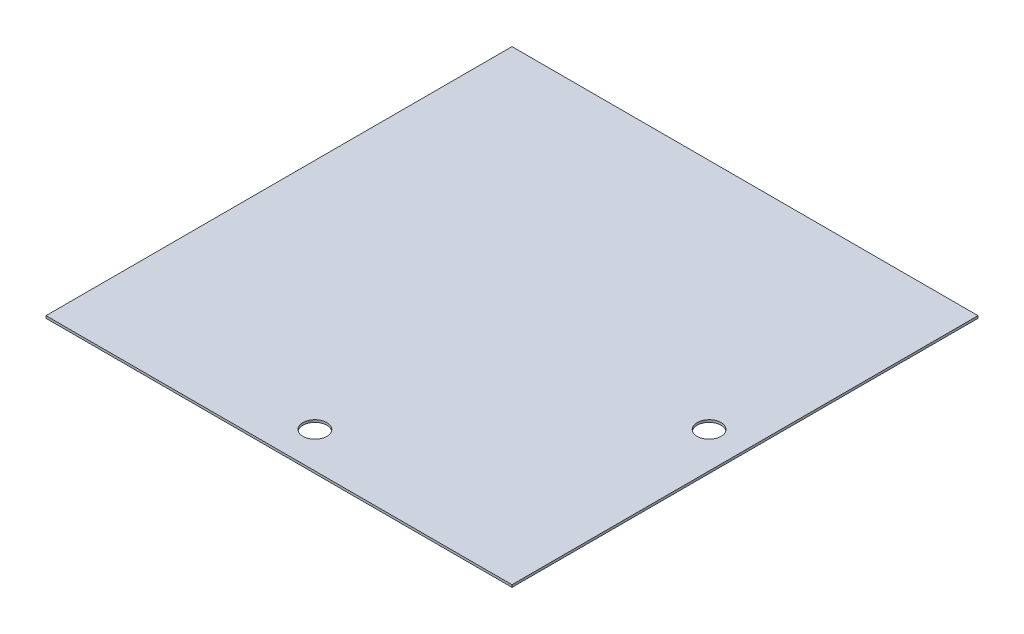
ISO-10303-21;
HEADER;
FILE_DESCRIPTION(('STEP AP214'),'2;1');
FILE_NAME('part.step','',(''),(''),'','','');
FILE_SCHEMA(('AUTOMOTIVE_DESIGN { 1 0 10303 214 1 1 1 1 }'));
ENDSEC;
DATA;
#1=APPLICATION_CONTEXT('core data for automotive mechanical design processes');
#2=APPLICATION_PROTOCOL_DEFINITION('international standard','automotive_design',2000,#1);
#3=PRODUCT_CONTEXT('',#1,'mechanical');
#4=PRODUCT('Part','Part','',(#3));
#5=PRODUCT_RELATED_PRODUCT_CATEGORY('part','',(#4));
#6=PRODUCT_DEFINITION_FORMATION('','',#4);
#7=PRODUCT_DEFINITION_CONTEXT('part definition',#1,'design');
#8=PRODUCT_DEFINITION('design','',#6,#7);
#9=PRODUCT_DEFINITION_SHAPE('','',#8);
#10=(LENGTH_UNIT() NAMED_UNIT(*) SI_UNIT(.MILLI.,.METRE.));
#11=(NAMED_UNIT(*) PLANE_ANGLE_UNIT() SI_UNIT($,.RADIAN.));
#12=(NAMED_UNIT(*) SI_UNIT($,.STERADIAN.) SOLID_ANGLE_UNIT());
#13=UNCERTAINTY_MEASURE_WITH_UNIT(LENGTH_MEASURE(1.E-05),#10,'distance_accuracy_value','');
#14=(GEOMETRIC_REPRESENTATION_CONTEXT(3) GLOBAL_UNCERTAINTY_ASSIGNED_CONTEXT((#13)) GLOBAL_UNIT_ASSIGNED_CONTEXT((#10,
#11,#12)) REPRESENTATION_CONTEXT('',''));
#15=CARTESIAN_POINT('',(0.,0.,0.));
#16=DIRECTION('',(0.,0.,1.));
#17=DIRECTION('',(1.,0.,0.));
#18=AXIS2_PLACEMENT_3D('',#15,#16,#17);
#19=CARTESIAN_POINT('',(247.4214,2.5,247.4214));
#20=DIRECTION('',(-1.,0.,0.));
#21=DIRECTION('',(0.,0.,1.));
#22=AXIS2_PLACEMENT_3D('',#19,#20,#21);
#23=PLANE('',#22);
#24=DIRECTION('',(0.,0.,-1.));
#25=VECTOR('',#24,1.);
#26=CARTESIAN_POINT('',(247.4214,0.,247.4214));
#27=LINE('',#26,#25);
#28=CARTESIAN_POINT('',(247.4214,0.,247.4214));
#29=VERTEX_POINT('',#28);
#30=CARTESIAN_POINT('',(247.4214,0.,-247.4214));
#31=VERTEX_POINT('',#30);
#32=EDGE_CURVE('E106',#29,#31,#27,.T.);
#33=ORIENTED_EDGE('',*,*,#32,.T.);
#34=DIRECTION('',(0.,-1.,0.));
#35=VECTOR('',#34,1.);
#36=CARTESIAN_POINT('',(247.4214,2.5,-247.4214));
#37=LINE('',#36,#35);
#38=CARTESIAN_POINT('',(247.4214,2.5,-247.4214));
#39=VERTEX_POINT('',#38);
#40=EDGE_CURVE('E11',#39,#31,#37,.T.);
#41=ORIENTED_EDGE('',*,*,#40,.F.);
#42=DIRECTION('',(0.,0.,-1.));
#43=VECTOR('',#42,1.);
#44=CARTESIAN_POINT('',(247.4214,2.5,247.4214));
#45=LINE('',#44,#43);
#46=CARTESIAN_POINT('',(247.4214,2.5,247.4214));
#47=VERTEX_POINT('',#46);
#48=EDGE_CURVE('E90',#47,#39,#45,.T.);
#49=ORIENTED_EDGE('',*,*,#48,.F.);
#50=DIRECTION('',(0.,-1.,0.));
#51=VECTOR('',#50,1.);
#52=CARTESIAN_POINT('',(247.4214,2.5,247.4214));
#53=LINE('',#52,#51);
#54=EDGE_CURVE('E102',#47,#29,#53,.T.);
#55=ORIENTED_EDGE('',*,*,#54,.T.);
#56=EDGE_LOOP('',(#33,#41,#49,#55));
#57=FACE_BOUND('',#56,.T.);
#58=ADVANCED_FACE('F38',(#57),#23,.F.);
#59=CARTESIAN_POINT('',(-247.4214,2.5,-247.4214));
#60=DIRECTION('',(0.,0.,1.));
#61=DIRECTION('',(1.,0.,0.));
#62=AXIS2_PLACEMENT_3D('',#59,#60,#61);
#63=PLANE('',#62);
#64=DIRECTION('',(-1.,0.,0.));
#65=VECTOR('',#64,1.);
#66=CARTESIAN_POINT('',(-247.4214,0.,-247.4214));
#67=LINE('',#66,#65);
#68=CARTESIAN_POINT('',(-247.4214,0.,-247.4214));
#69=VERTEX_POINT('',#68);
#70=EDGE_CURVE('E95',#31,#69,#67,.T.);
#71=ORIENTED_EDGE('',*,*,#70,.T.);
#72=DIRECTION('',(0.,-1.,0.));
#73=VECTOR('',#72,1.);
#74=CARTESIAN_POINT('',(-247.4214,2.5,-247.4214));
#75=LINE('',#74,#73);
#76=CARTESIAN_POINT('',(-247.4214,2.5,-247.4214));
#77=VERTEX_POINT('',#76);
#78=EDGE_CURVE('E47',#77,#69,#75,.T.);
#79=ORIENTED_EDGE('',*,*,#78,.F.);
#80=DIRECTION('',(-1.,0.,0.));
#81=VECTOR('',#80,1.);
#82=CARTESIAN_POINT('',(-247.4214,2.5,-247.4214));
#83=LINE('',#82,#81);
#84=EDGE_CURVE('E85',#39,#77,#83,.T.);
#85=ORIENTED_EDGE('',*,*,#84,.F.);
#86=ORIENTED_EDGE('',*,*,#40,.T.);
#87=EDGE_LOOP('',(#71,#79,#85,#86));
#88=FACE_BOUND('',#87,.T.);
#89=ADVANCED_FACE('F94',(#88),#63,.F.);
#90=CARTESIAN_POINT('',(-247.4214,2.5,247.4214));
#91=DIRECTION('',(1.,0.,0.));
#92=DIRECTION('',(0.,0.,-1.));
#93=AXIS2_PLACEMENT_3D('',#90,#91,#92);
#94=PLANE('',#93);
#95=DIRECTION('',(0.,0.,1.));
#96=VECTOR('',#95,1.);
#97=CARTESIAN_POINT('',(-247.4214,0.,247.4214));
#98=LINE('',#97,#96);
#99=CARTESIAN_POINT('',(-247.4214,0.,247.4214));
#100=VERTEX_POINT('',#99);
#101=EDGE_CURVE('E72',#69,#100,#98,.T.);
#102=ORIENTED_EDGE('',*,*,#101,.T.);
#103=DIRECTION('',(0.,-1.,0.));
#104=VECTOR('',#103,1.);
#105=CARTESIAN_POINT('',(-247.4214,2.5,247.4214));
#106=LINE('',#105,#104);
#107=CARTESIAN_POINT('',(-247.4214,2.5,247.4214));
#108=VERTEX_POINT('',#107);
#109=EDGE_CURVE('E97',#108,#100,#106,.T.);
#110=ORIENTED_EDGE('',*,*,#109,.F.);
#111=DIRECTION('',(0.,0.,1.));
#112=VECTOR('',#111,1.);
#113=CARTESIAN_POINT('',(-247.4214,2.5,247.4214));
#114=LINE('',#113,#112);
#115=EDGE_CURVE('E88',#77,#108,#114,.T.);
#116=ORIENTED_EDGE('',*,*,#115,.F.);
#117=ORIENTED_EDGE('',*,*,#78,.T.);
#118=EDGE_LOOP('',(#102,#110,#116,#117));
#119=FACE_BOUND('',#118,.T.);
#120=ADVANCED_FACE('F98',(#119),#94,.F.);
#121=CARTESIAN_POINT('',(-247.4214,2.5,247.4214));
#122=DIRECTION('',(0.,0.,-1.));
#123=DIRECTION('',(-1.,0.,0.));
#124=AXIS2_PLACEMENT_3D('',#121,#122,#123);
#125=PLANE('',#124);
#126=DIRECTION('',(1.,0.,0.));
#127=VECTOR('',#126,1.);
#128=CARTESIAN_POINT('',(-247.4214,0.,247.4214));
#129=LINE('',#128,#127);
#130=EDGE_CURVE('E78',#100,#29,#129,.T.);
#131=ORIENTED_EDGE('',*,*,#130,.T.);
#132=ORIENTED_EDGE('',*,*,#54,.F.);
#133=DIRECTION('',(1.,0.,0.));
#134=VECTOR('',#133,1.);
#135=CARTESIAN_POINT('',(-247.4214,2.5,247.4214));
#136=LINE('',#135,#134);
#137=EDGE_CURVE('E55',#108,#47,#136,.T.);
#138=ORIENTED_EDGE('',*,*,#137,.F.);
#139=ORIENTED_EDGE('',*,*,#109,.T.);
#140=EDGE_LOOP('',(#131,#132,#138,#139));
#141=FACE_BOUND('',#140,.T.);
#142=ADVANCED_FACE('F120',(#141),#125,.F.);
#143=CARTESIAN_POINT('',(0.,2.5,0.));
#144=DIRECTION('',(0.,-1.,0.));
#145=DIRECTION('',(0.,0.,-1.));
#146=AXIS2_PLACEMENT_3D('',#143,#144,#145);
#147=PLANE('',#146);
#148=CARTESIAN_POINT('',(209.3214,2.5,0.));
#149=DIRECTION('',(0.,1.,0.));
#150=DIRECTION('',(0.,0.,1.));
#151=AXIS2_PLACEMENT_3D('',#148,#149,#150);
#152=CIRCLE('',#151,12.7);
#153=CARTESIAN_POINT('',(209.3214,2.5,12.7));
#154=VERTEX_POINT('',#153);
#155=EDGE_CURVE('E135',#154,#154,#152,.T.);
#156=ORIENTED_EDGE('',*,*,#155,.F.);
#157=EDGE_LOOP('',(#156));
#158=FACE_BOUND('',#157,.T.);
#159=CARTESIAN_POINT('',(0.,2.5,209.3214));
#160=DIRECTION('',(0.,1.,0.));
#161=DIRECTION('',(0.,0.,1.));
#162=AXIS2_PLACEMENT_3D('',#159,#160,#161);
#163=CIRCLE('',#162,12.7);
#164=CARTESIAN_POINT('',(0.,2.5,222.0214));
#165=VERTEX_POINT('',#164);
#166=EDGE_CURVE('E127',#165,#165,#163,.T.);
#167=ORIENTED_EDGE('',*,*,#166,.F.);
#168=EDGE_LOOP('',(#167));
#169=FACE_BOUND('',#168,.T.);
#170=ORIENTED_EDGE('',*,*,#48,.T.);
#171=ORIENTED_EDGE('',*,*,#84,.T.);
#172=ORIENTED_EDGE('',*,*,#115,.T.);
#173=ORIENTED_EDGE('',*,*,#137,.T.);
#174=EDGE_LOOP('',(#170,#171,#172,#173));
#175=FACE_BOUND('',#174,.T.);
#176=ADVANCED_FACE('F86',(#158,#169,#175),#147,.F.);
#177=CARTESIAN_POINT('',(0.,0.,0.));
#178=DIRECTION('',(0.,-1.,0.));
#179=DIRECTION('',(0.,0.,-1.));
#180=AXIS2_PLACEMENT_3D('',#177,#178,#179);
#181=PLANE('',#180);
#182=CARTESIAN_POINT('',(209.3214,0.,0.));
#183=DIRECTION('',(0.,1.,0.));
#184=DIRECTION('',(0.,0.,1.));
#185=AXIS2_PLACEMENT_3D('',#182,#183,#184);
#186=CIRCLE('',#185,12.7);
#187=CARTESIAN_POINT('',(209.3214,0.,12.7));
#188=VERTEX_POINT('',#187);
#189=EDGE_CURVE('E110',#188,#188,#186,.T.);
#190=ORIENTED_EDGE('',*,*,#189,.T.);
#191=EDGE_LOOP('',(#190));
#192=FACE_BOUND('',#191,.T.);
#193=CARTESIAN_POINT('',(0.,0.,209.3214));
#194=DIRECTION('',(0.,1.,0.));
#195=DIRECTION('',(0.,0.,1.));
#196=AXIS2_PLACEMENT_3D('',#193,#194,#195);
#197=CIRCLE('',#196,12.7);
#198=CARTESIAN_POINT('',(0.,0.,222.0214));
#199=VERTEX_POINT('',#198);
#200=EDGE_CURVE('E131',#199,#199,#197,.T.);
#201=ORIENTED_EDGE('',*,*,#200,.T.);
#202=EDGE_LOOP('',(#201));
#203=FACE_BOUND('',#202,.T.);
#204=ORIENTED_EDGE('',*,*,#32,.F.);
#205=ORIENTED_EDGE('',*,*,#130,.F.);
#206=ORIENTED_EDGE('',*,*,#101,.F.);
#207=ORIENTED_EDGE('',*,*,#70,.F.);
#208=EDGE_LOOP('',(#204,#205,#206,#207));
#209=FACE_BOUND('',#208,.T.);
#210=ADVANCED_FACE('F123',(#192,#203,#209),#181,.T.);
#211=CARTESIAN_POINT('',(0.,0.,209.3214));
#212=DIRECTION('',(0.,1.,0.));
#213=DIRECTION('',(0.,0.,1.));
#214=AXIS2_PLACEMENT_3D('',#211,#212,#213);
#215=CYLINDRICAL_SURFACE('',#214,12.7);
#216=ORIENTED_EDGE('',*,*,#200,.F.);
#217=EDGE_LOOP('',(#216));
#218=FACE_BOUND('',#217,.T.);
#219=ORIENTED_EDGE('',*,*,#166,.T.);
#220=EDGE_LOOP('',(#219));
#221=FACE_BOUND('',#220,.T.);
#222=ADVANCED_FACE('F148',(#218,#221),#215,.F.);
#223=CARTESIAN_POINT('',(209.3214,0.,0.));
#224=DIRECTION('',(0.,1.,0.));
#225=DIRECTION('',(0.,0.,1.));
#226=AXIS2_PLACEMENT_3D('',#223,#224,#225);
#227=CYLINDRICAL_SURFACE('',#226,12.7);
#228=ORIENTED_EDGE('',*,*,#189,.F.);
#229=EDGE_LOOP('',(#228));
#230=FACE_BOUND('',#229,.T.);
#231=ORIENTED_EDGE('',*,*,#155,.T.);
#232=EDGE_LOOP('',(#231));
#233=FACE_BOUND('',#232,.T.);
#234=ADVANCED_FACE('F145',(#230,#233),#227,.F.);
#235=CLOSED_SHELL('',(#58,#89,#120,#142,#176,#210,#222,#234));
#236=MANIFOLD_SOLID_BREP('B2',#235);
#237=ADVANCED_BREP_SHAPE_REPRESENTATION('',(#18,#236),#14);
#238=SHAPE_DEFINITION_REPRESENTATION(#9,#237);
ENDSEC;
END-ISO-10303-21;
